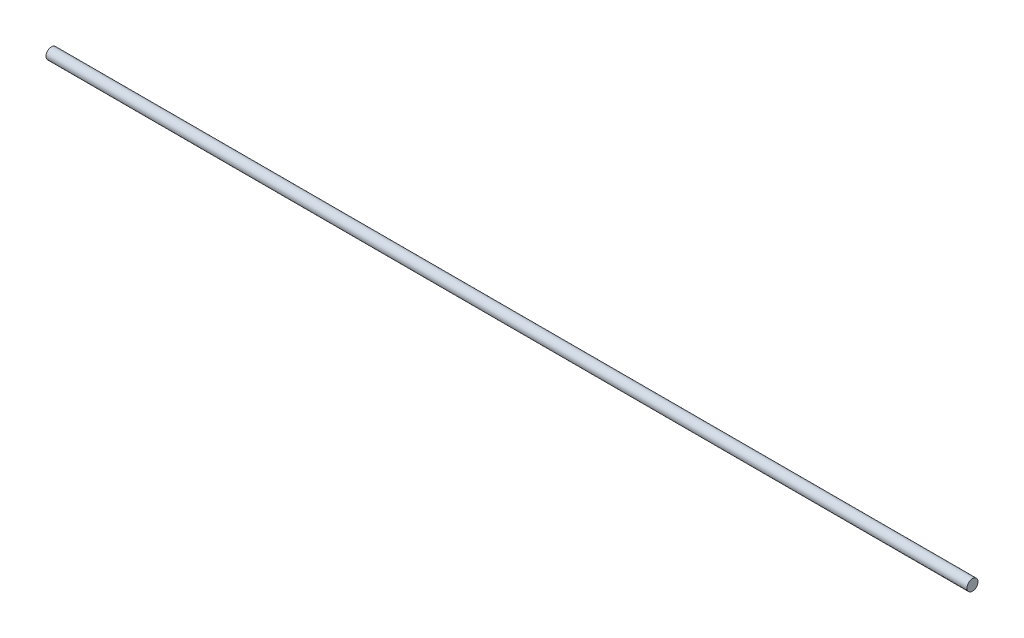
ISO-10303-21;
HEADER;
FILE_DESCRIPTION(('STEP AP214'),'2;1');
FILE_NAME('part.step','',(''),(''),'','','');
FILE_SCHEMA(('AUTOMOTIVE_DESIGN { 1 0 10303 214 1 1 1 1 }'));
ENDSEC;
DATA;
#1=APPLICATION_CONTEXT('core data for automotive mechanical design processes');
#2=APPLICATION_PROTOCOL_DEFINITION('international standard','automotive_design',2000,#1);
#3=PRODUCT_CONTEXT('',#1,'mechanical');
#4=PRODUCT('Part','Part','',(#3));
#5=PRODUCT_RELATED_PRODUCT_CATEGORY('part','',(#4));
#6=PRODUCT_DEFINITION_FORMATION('','',#4);
#7=PRODUCT_DEFINITION_CONTEXT('part definition',#1,'design');
#8=PRODUCT_DEFINITION('design','',#6,#7);
#9=PRODUCT_DEFINITION_SHAPE('','',#8);
#10=(LENGTH_UNIT() NAMED_UNIT(*) SI_UNIT(.MILLI.,.METRE.));
#11=(NAMED_UNIT(*) PLANE_ANGLE_UNIT() SI_UNIT($,.RADIAN.));
#12=(NAMED_UNIT(*) SI_UNIT($,.STERADIAN.) SOLID_ANGLE_UNIT());
#13=UNCERTAINTY_MEASURE_WITH_UNIT(LENGTH_MEASURE(1.E-05),#10,'distance_accuracy_value','');
#14=(GEOMETRIC_REPRESENTATION_CONTEXT(3) GLOBAL_UNCERTAINTY_ASSIGNED_CONTEXT((#13)) GLOBAL_UNIT_ASSIGNED_CONTEXT((#10,
#11,#12)) REPRESENTATION_CONTEXT('',''));
#15=CARTESIAN_POINT('',(0.,0.,0.));
#16=DIRECTION('',(0.,0.,1.));
#17=DIRECTION('',(1.,0.,0.));
#18=AXIS2_PLACEMENT_3D('',#15,#16,#17);
#19=CARTESIAN_POINT('',(276.225,0.,0.));
#20=DIRECTION('',(-1.,0.,0.));
#21=DIRECTION('',(0.,0.,1.));
#22=AXIS2_PLACEMENT_3D('',#19,#20,#21);
#23=CYLINDRICAL_SURFACE('',#22,1.651);
#24=CARTESIAN_POINT('',(276.225,0.,0.));
#25=DIRECTION('',(1.,0.,0.));
#26=DIRECTION('',(0.,0.,-1.));
#27=AXIS2_PLACEMENT_3D('',#24,#25,#26);
#28=CIRCLE('',#27,1.651);
#29=CARTESIAN_POINT('',(276.225,0.,-1.651));
#30=VERTEX_POINT('',#29);
#31=EDGE_CURVE('E10',#30,#30,#28,.T.);
#32=ORIENTED_EDGE('',*,*,#31,.F.);
#33=EDGE_LOOP('',(#32));
#34=FACE_BOUND('',#33,.T.);
#35=CARTESIAN_POINT('',(0.,0.,0.));
#36=DIRECTION('',(1.,0.,0.));
#37=DIRECTION('',(0.,0.,-1.));
#38=AXIS2_PLACEMENT_3D('',#35,#36,#37);
#39=CIRCLE('',#38,1.651);
#40=CARTESIAN_POINT('',(0.,0.,-1.651));
#41=VERTEX_POINT('',#40);
#42=EDGE_CURVE('E46',#41,#41,#39,.T.);
#43=ORIENTED_EDGE('',*,*,#42,.T.);
#44=EDGE_LOOP('',(#43));
#45=FACE_BOUND('',#44,.T.);
#46=ADVANCED_FACE('F43',(#34,#45),#23,.T.);
#47=CARTESIAN_POINT('',(276.225,0.,0.));
#48=DIRECTION('',(1.,0.,0.));
#49=DIRECTION('',(0.,0.,-1.));
#50=AXIS2_PLACEMENT_3D('',#47,#48,#49);
#51=PLANE('',#50);
#52=ORIENTED_EDGE('',*,*,#31,.T.);
#53=EDGE_LOOP('',(#52));
#54=FACE_BOUND('',#53,.T.);
#55=ADVANCED_FACE('F60',(#54),#51,.T.);
#56=CARTESIAN_POINT('',(0.,0.,0.));
#57=DIRECTION('',(1.,0.,0.));
#58=DIRECTION('',(0.,0.,-1.));
#59=AXIS2_PLACEMENT_3D('',#56,#57,#58);
#60=PLANE('',#59);
#61=ORIENTED_EDGE('',*,*,#42,.F.);
#62=EDGE_LOOP('',(#61));
#63=FACE_BOUND('',#62,.T.);
#64=ADVANCED_FACE('F58',(#63),#60,.F.);
#65=CLOSED_SHELL('',(#46,#55,#64));
#66=MANIFOLD_SOLID_BREP('B2',#65);
#67=ADVANCED_BREP_SHAPE_REPRESENTATION('',(#18,#66),#14);
#68=SHAPE_DEFINITION_REPRESENTATION(#9,#67);
ENDSEC;
END-ISO-10303-21;
